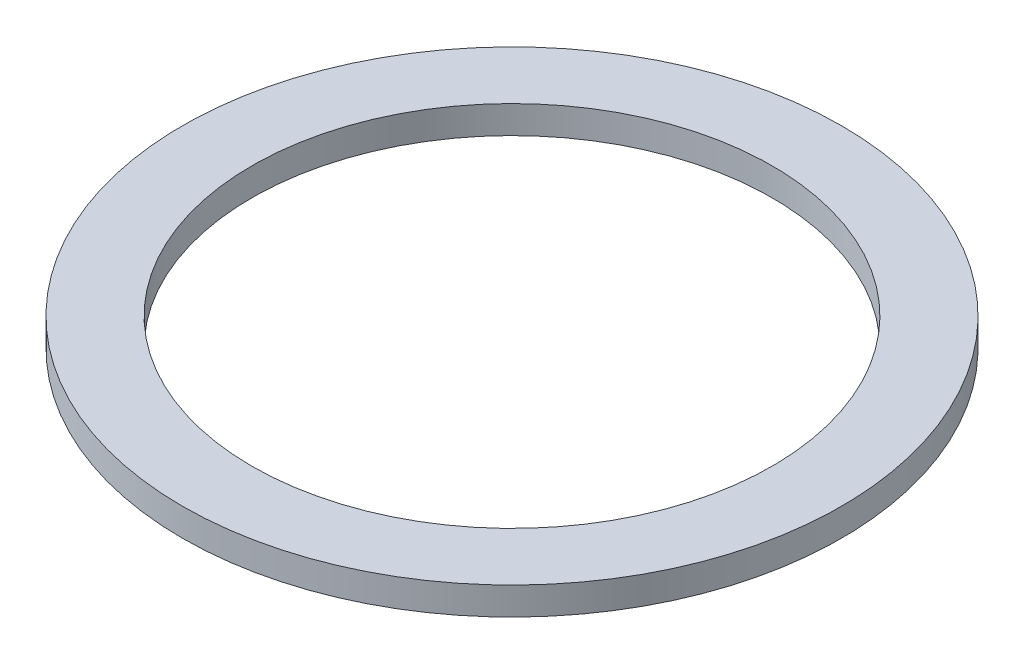
ISO-10303-21;
HEADER;
FILE_DESCRIPTION(('STEP AP214'),'2;1');
FILE_NAME('part.step','',(''),(''),'','','');
FILE_SCHEMA(('AUTOMOTIVE_DESIGN { 1 0 10303 214 1 1 1 1 }'));
ENDSEC;
DATA;
#1=APPLICATION_CONTEXT('core data for automotive mechanical design processes');
#2=APPLICATION_PROTOCOL_DEFINITION('international standard','automotive_design',2000,#1);
#3=PRODUCT_CONTEXT('',#1,'mechanical');
#4=PRODUCT('Part','Part','',(#3));
#5=PRODUCT_RELATED_PRODUCT_CATEGORY('part','',(#4));
#6=PRODUCT_DEFINITION_FORMATION('','',#4);
#7=PRODUCT_DEFINITION_CONTEXT('part definition',#1,'design');
#8=PRODUCT_DEFINITION('design','',#6,#7);
#9=PRODUCT_DEFINITION_SHAPE('','',#8);
#10=(LENGTH_UNIT() NAMED_UNIT(*) SI_UNIT(.MILLI.,.METRE.));
#11=(NAMED_UNIT(*) PLANE_ANGLE_UNIT() SI_UNIT($,.RADIAN.));
#12=(NAMED_UNIT(*) SI_UNIT($,.STERADIAN.) SOLID_ANGLE_UNIT());
#13=UNCERTAINTY_MEASURE_WITH_UNIT(LENGTH_MEASURE(1.E-05),#10,'distance_accuracy_value','');
#14=(GEOMETRIC_REPRESENTATION_CONTEXT(3) GLOBAL_UNCERTAINTY_ASSIGNED_CONTEXT((#13)) GLOBAL_UNIT_ASSIGNED_CONTEXT((#10,
#11,#12)) REPRESENTATION_CONTEXT('',''));
#15=CARTESIAN_POINT('',(0.,0.,0.));
#16=DIRECTION('',(0.,0.,1.));
#17=DIRECTION('',(1.,0.,0.));
#18=AXIS2_PLACEMENT_3D('',#15,#16,#17);
#19=CARTESIAN_POINT('',(0.,4.,0.));
#20=DIRECTION('',(0.,-1.,0.));
#21=DIRECTION('',(0.,0.,-1.));
#22=AXIS2_PLACEMENT_3D('',#19,#20,#21);
#23=CYLINDRICAL_SURFACE('',#22,47.5);
#24=CARTESIAN_POINT('',(0.,4.,0.));
#25=DIRECTION('',(0.,1.,0.));
#26=DIRECTION('',(0.,0.,1.));
#27=AXIS2_PLACEMENT_3D('',#24,#25,#26);
#28=CIRCLE('',#27,47.5);
#29=CARTESIAN_POINT('',(0.,4.,47.5));
#30=VERTEX_POINT('',#29);
#31=EDGE_CURVE('E10',#30,#30,#28,.T.);
#32=ORIENTED_EDGE('',*,*,#31,.F.);
#33=EDGE_LOOP('',(#32));
#34=FACE_BOUND('',#33,.T.);
#35=CARTESIAN_POINT('',(0.,0.,0.));
#36=DIRECTION('',(0.,1.,0.));
#37=DIRECTION('',(0.,0.,1.));
#38=AXIS2_PLACEMENT_3D('',#35,#36,#37);
#39=CIRCLE('',#38,47.5);
#40=CARTESIAN_POINT('',(0.,0.,47.5));
#41=VERTEX_POINT('',#40);
#42=EDGE_CURVE('E37',#41,#41,#39,.T.);
#43=ORIENTED_EDGE('',*,*,#42,.T.);
#44=EDGE_LOOP('',(#43));
#45=FACE_BOUND('',#44,.T.);
#46=ADVANCED_FACE('F40',(#34,#45),#23,.T.);
#47=CARTESIAN_POINT('',(0.,4.,0.));
#48=DIRECTION('',(0.,1.,0.));
#49=DIRECTION('',(0.,0.,1.));
#50=AXIS2_PLACEMENT_3D('',#47,#48,#49);
#51=PLANE('',#50);
#52=CARTESIAN_POINT('',(0.,4.,0.));
#53=DIRECTION('',(0.,1.,0.));
#54=DIRECTION('',(0.,0.,1.));
#55=AXIS2_PLACEMENT_3D('',#52,#53,#54);
#56=CIRCLE('',#55,37.5);
#57=CARTESIAN_POINT('',(0.,4.,37.5));
#58=VERTEX_POINT('',#57);
#59=EDGE_CURVE('E50',#58,#58,#56,.T.);
#60=ORIENTED_EDGE('',*,*,#59,.F.);
#61=EDGE_LOOP('',(#60));
#62=FACE_BOUND('',#61,.T.);
#63=ORIENTED_EDGE('',*,*,#31,.T.);
#64=EDGE_LOOP('',(#63));
#65=FACE_BOUND('',#64,.T.);
#66=ADVANCED_FACE('F59',(#62,#65),#51,.T.);
#67=CARTESIAN_POINT('',(0.,0.,0.));
#68=DIRECTION('',(0.,1.,0.));
#69=DIRECTION('',(0.,0.,1.));
#70=AXIS2_PLACEMENT_3D('',#67,#68,#69);
#71=PLANE('',#70);
#72=CARTESIAN_POINT('',(0.,0.,0.));
#73=DIRECTION('',(0.,1.,0.));
#74=DIRECTION('',(0.,0.,1.));
#75=AXIS2_PLACEMENT_3D('',#72,#73,#74);
#76=CIRCLE('',#75,37.5);
#77=CARTESIAN_POINT('',(0.,0.,37.5));
#78=VERTEX_POINT('',#77);
#79=EDGE_CURVE('E47',#78,#78,#76,.T.);
#80=ORIENTED_EDGE('',*,*,#79,.T.);
#81=EDGE_LOOP('',(#80));
#82=FACE_BOUND('',#81,.T.);
#83=ORIENTED_EDGE('',*,*,#42,.F.);
#84=EDGE_LOOP('',(#83));
#85=FACE_BOUND('',#84,.T.);
#86=ADVANCED_FACE('F58',(#82,#85),#71,.F.);
#87=CARTESIAN_POINT('',(0.,4.,0.));
#88=DIRECTION('',(0.,-1.,0.));
#89=DIRECTION('',(0.,0.,-1.));
#90=AXIS2_PLACEMENT_3D('',#87,#88,#89);
#91=CYLINDRICAL_SURFACE('',#90,37.5);
#92=ORIENTED_EDGE('',*,*,#59,.T.);
#93=EDGE_LOOP('',(#92));
#94=FACE_BOUND('',#93,.T.);
#95=ORIENTED_EDGE('',*,*,#79,.F.);
#96=EDGE_LOOP('',(#95));
#97=FACE_BOUND('',#96,.T.);
#98=ADVANCED_FACE('F54',(#94,#97),#91,.F.);
#99=CLOSED_SHELL('',(#46,#66,#86,#98));
#100=MANIFOLD_SOLID_BREP('B2',#99);
#101=ADVANCED_BREP_SHAPE_REPRESENTATION('',(#18,#100),#14);
#102=SHAPE_DEFINITION_REPRESENTATION(#9,#101);
ENDSEC;
END-ISO-10303-21;
